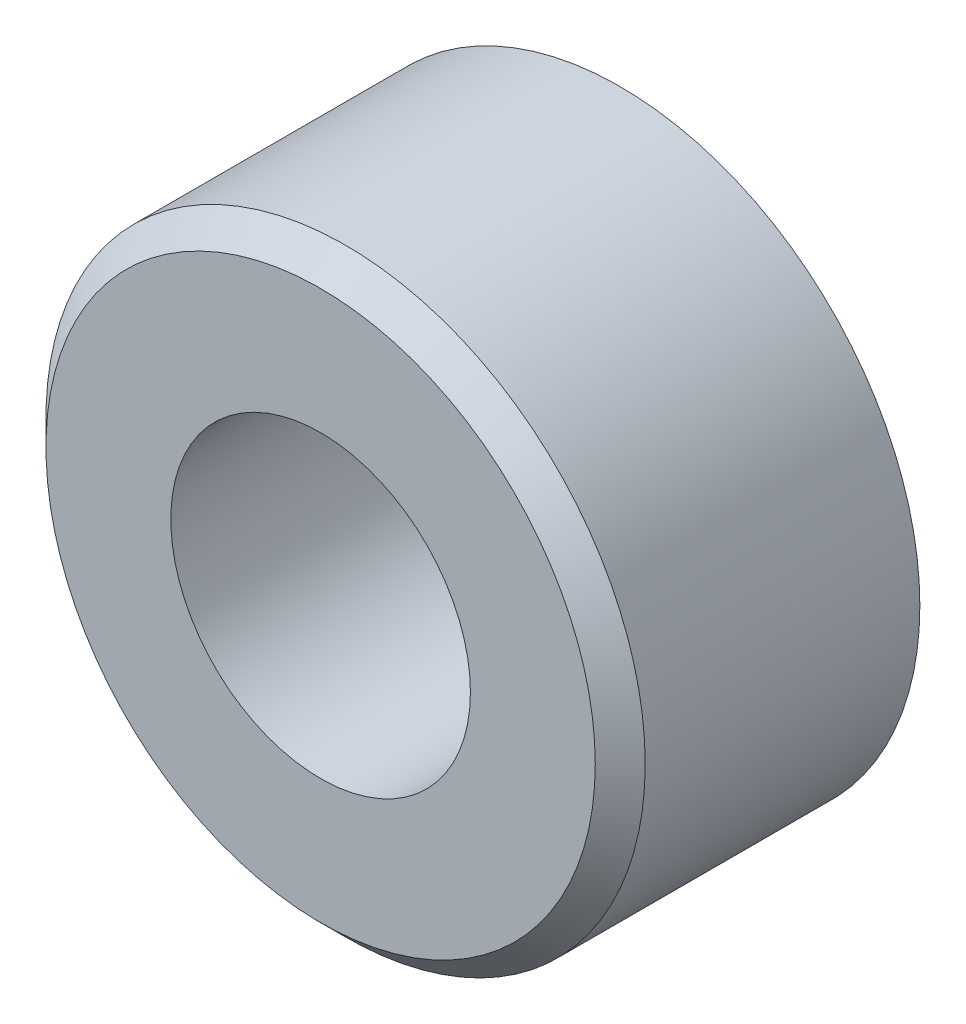
ISO-10303-21;
HEADER;
FILE_DESCRIPTION(('STEP AP214'),'2;1');
FILE_NAME('part.step','',(''),(''),'','','');
FILE_SCHEMA(('AUTOMOTIVE_DESIGN { 1 0 10303 214 1 1 1 1 }'));
ENDSEC;
DATA;
#1=APPLICATION_CONTEXT('core data for automotive mechanical design processes');
#2=APPLICATION_PROTOCOL_DEFINITION('international standard','automotive_design',2000,#1);
#3=PRODUCT_CONTEXT('',#1,'mechanical');
#4=PRODUCT('Part','Part','',(#3));
#5=PRODUCT_RELATED_PRODUCT_CATEGORY('part','',(#4));
#6=PRODUCT_DEFINITION_FORMATION('','',#4);
#7=PRODUCT_DEFINITION_CONTEXT('part definition',#1,'design');
#8=PRODUCT_DEFINITION('design','',#6,#7);
#9=PRODUCT_DEFINITION_SHAPE('','',#8);
#10=(LENGTH_UNIT() NAMED_UNIT(*) SI_UNIT(.MILLI.,.METRE.));
#11=(NAMED_UNIT(*) PLANE_ANGLE_UNIT() SI_UNIT($,.RADIAN.));
#12=(NAMED_UNIT(*) SI_UNIT($,.STERADIAN.) SOLID_ANGLE_UNIT());
#13=UNCERTAINTY_MEASURE_WITH_UNIT(LENGTH_MEASURE(1.E-05),#10,'distance_accuracy_value','');
#14=(GEOMETRIC_REPRESENTATION_CONTEXT(3) GLOBAL_UNCERTAINTY_ASSIGNED_CONTEXT((#13)) GLOBAL_UNIT_ASSIGNED_CONTEXT((#10,
#11,#12)) REPRESENTATION_CONTEXT('',''));
#15=CARTESIAN_POINT('',(0.,0.,0.));
#16=DIRECTION('',(0.,0.,1.));
#17=DIRECTION('',(1.,0.,0.));
#18=AXIS2_PLACEMENT_3D('',#15,#16,#17);
#19=CARTESIAN_POINT('',(0.,0.,6.));
#20=DIRECTION('',(0.,0.,1.));
#21=DIRECTION('',(1.,0.,0.));
#22=AXIS2_PLACEMENT_3D('',#19,#20,#21);
#23=PLANE('',#22);
#24=CARTESIAN_POINT('',(0.,0.,6.));
#25=DIRECTION('',(0.,0.,1.));
#26=DIRECTION('',(1.,0.,0.));
#27=AXIS2_PLACEMENT_3D('',#24,#25,#26);
#28=CIRCLE('',#27,5.5);
#29=CARTESIAN_POINT('',(5.5,0.,6.));
#30=VERTEX_POINT('',#29);
#31=EDGE_CURVE('E39',#30,#30,#28,.T.);
#32=ORIENTED_EDGE('',*,*,#31,.T.);
#33=EDGE_LOOP('',(#32));
#34=FACE_BOUND('',#33,.T.);
#35=CARTESIAN_POINT('',(0.,0.,6.));
#36=DIRECTION('',(0.,0.,1.));
#37=DIRECTION('',(1.,0.,0.));
#38=AXIS2_PLACEMENT_3D('',#35,#36,#37);
#39=CIRCLE('',#38,3.);
#40=CARTESIAN_POINT('',(3.,0.,6.));
#41=VERTEX_POINT('',#40);
#42=EDGE_CURVE('E47',#41,#41,#39,.T.);
#43=ORIENTED_EDGE('',*,*,#42,.F.);
#44=EDGE_LOOP('',(#43));
#45=FACE_BOUND('',#44,.T.);
#46=ADVANCED_FACE('F32',(#34,#45),#23,.T.);
#47=CARTESIAN_POINT('',(0.,0.,0.));
#48=DIRECTION('',(0.,0.,1.));
#49=DIRECTION('',(1.,0.,0.));
#50=AXIS2_PLACEMENT_3D('',#47,#48,#49);
#51=PLANE('',#50);
#52=CARTESIAN_POINT('',(0.,0.,0.));
#53=DIRECTION('',(0.,0.,1.));
#54=DIRECTION('',(1.,0.,0.));
#55=AXIS2_PLACEMENT_3D('',#52,#53,#54);
#56=CIRCLE('',#55,6.);
#57=CARTESIAN_POINT('',(6.,0.,0.));
#58=VERTEX_POINT('',#57);
#59=EDGE_CURVE('E43',#58,#58,#56,.T.);
#60=ORIENTED_EDGE('',*,*,#59,.F.);
#61=EDGE_LOOP('',(#60));
#62=FACE_BOUND('',#61,.T.);
#63=CARTESIAN_POINT('',(0.,0.,0.));
#64=DIRECTION('',(0.,0.,1.));
#65=DIRECTION('',(1.,0.,0.));
#66=AXIS2_PLACEMENT_3D('',#63,#64,#65);
#67=CIRCLE('',#66,3.);
#68=CARTESIAN_POINT('',(3.,0.,0.));
#69=VERTEX_POINT('',#68);
#70=EDGE_CURVE('E50',#69,#69,#67,.T.);
#71=ORIENTED_EDGE('',*,*,#70,.T.);
#72=EDGE_LOOP('',(#71));
#73=FACE_BOUND('',#72,.T.);
#74=ADVANCED_FACE('F60',(#62,#73),#51,.F.);
#75=CARTESIAN_POINT('',(0.,0.,6.));
#76=DIRECTION('',(0.,0.,-1.));
#77=DIRECTION('',(-1.,0.,0.));
#78=AXIS2_PLACEMENT_3D('',#75,#76,#77);
#79=CYLINDRICAL_SURFACE('',#78,6.);
#80=CARTESIAN_POINT('',(0.,0.,5.49999999999999));
#81=DIRECTION('',(0.,0.,1.));
#82=DIRECTION('',(1.,0.,0.));
#83=AXIS2_PLACEMENT_3D('',#80,#81,#82);
#84=CIRCLE('',#83,6.);
#85=CARTESIAN_POINT('',(6.,0.,5.49999999999999));
#86=VERTEX_POINT('',#85);
#87=EDGE_CURVE('E10',#86,#86,#84,.F.);
#88=ORIENTED_EDGE('',*,*,#87,.T.);
#89=EDGE_LOOP('',(#88));
#90=FACE_BOUND('',#89,.T.);
#91=ORIENTED_EDGE('',*,*,#59,.T.);
#92=EDGE_LOOP('',(#91));
#93=FACE_BOUND('',#92,.T.);
#94=ADVANCED_FACE('F65',(#90,#93),#79,.T.);
#95=CARTESIAN_POINT('',(0.,0.,6.));
#96=DIRECTION('',(0.,0.,-1.));
#97=DIRECTION('',(-1.,0.,0.));
#98=AXIS2_PLACEMENT_3D('',#95,#96,#97);
#99=CYLINDRICAL_SURFACE('',#98,3.);
#100=ORIENTED_EDGE('',*,*,#42,.T.);
#101=EDGE_LOOP('',(#100));
#102=FACE_BOUND('',#101,.T.);
#103=ORIENTED_EDGE('',*,*,#70,.F.);
#104=EDGE_LOOP('',(#103));
#105=FACE_BOUND('',#104,.T.);
#106=ADVANCED_FACE('F56',(#102,#105),#99,.F.);
#107=CARTESIAN_POINT('',(0.,0.,6.));
#108=DIRECTION('',(0.,0.,-1.));
#109=DIRECTION('',(-1.,0.,0.));
#110=AXIS2_PLACEMENT_3D('',#107,#108,#109);
#111=CONICAL_SURFACE('',#110,5.5,0.785398163397447);
#112=ORIENTED_EDGE('',*,*,#87,.F.);
#113=EDGE_LOOP('',(#112));
#114=FACE_BOUND('',#113,.T.);
#115=ORIENTED_EDGE('',*,*,#31,.F.);
#116=EDGE_LOOP('',(#115));
#117=FACE_BOUND('',#116,.T.);
#118=ADVANCED_FACE('F34',(#114,#117),#111,.T.);
#119=CLOSED_SHELL('',(#46,#74,#94,#106,#118));
#120=MANIFOLD_SOLID_BREP('B2',#119);
#121=ADVANCED_BREP_SHAPE_REPRESENTATION('',(#18,#120),#14);
#122=SHAPE_DEFINITION_REPRESENTATION(#9,#121);
ENDSEC;
END-ISO-10303-21;
